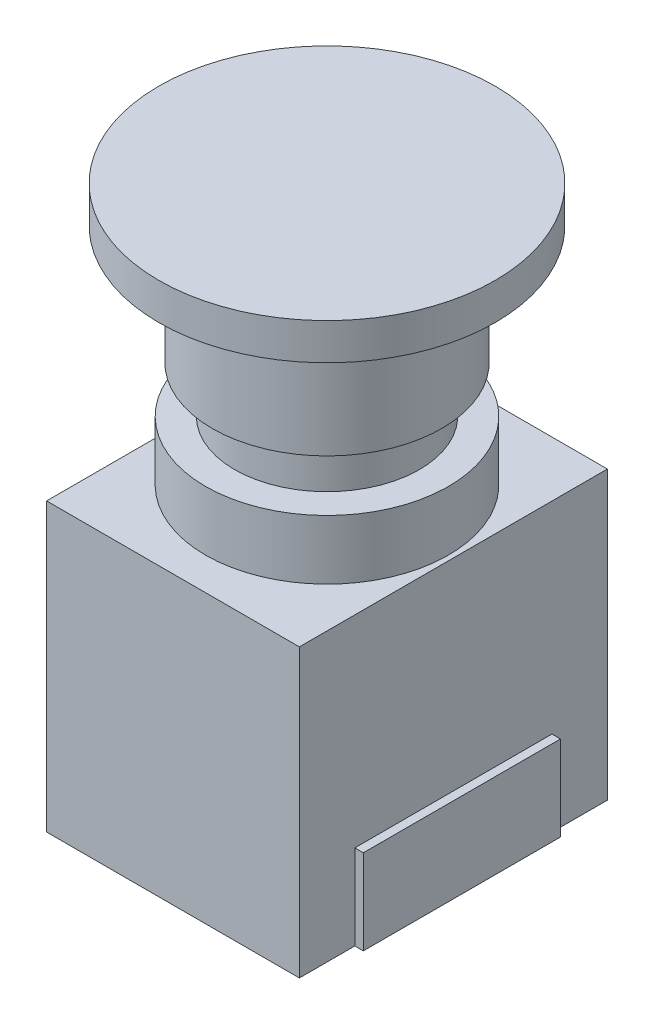
ISO-10303-21;
HEADER;
FILE_DESCRIPTION(('STEP AP214'),'2;1');
FILE_NAME('part.step','',(''),(''),'','','');
FILE_SCHEMA(('AUTOMOTIVE_DESIGN { 1 0 10303 214 1 1 1 1 }'));
ENDSEC;
DATA;
#1=APPLICATION_CONTEXT('core data for automotive mechanical design processes');
#2=APPLICATION_PROTOCOL_DEFINITION('international standard','automotive_design',2000,#1);
#3=PRODUCT_CONTEXT('',#1,'mechanical');
#4=PRODUCT('Part','Part','',(#3));
#5=PRODUCT_RELATED_PRODUCT_CATEGORY('part','',(#4));
#6=PRODUCT_DEFINITION_FORMATION('','',#4);
#7=PRODUCT_DEFINITION_CONTEXT('part definition',#1,'design');
#8=PRODUCT_DEFINITION('design','',#6,#7);
#9=PRODUCT_DEFINITION_SHAPE('','',#8);
#10=(LENGTH_UNIT() NAMED_UNIT(*) SI_UNIT(.MILLI.,.METRE.));
#11=(NAMED_UNIT(*) PLANE_ANGLE_UNIT() SI_UNIT($,.RADIAN.));
#12=(NAMED_UNIT(*) SI_UNIT($,.STERADIAN.) SOLID_ANGLE_UNIT());
#13=UNCERTAINTY_MEASURE_WITH_UNIT(LENGTH_MEASURE(1.E-05),#10,'distance_accuracy_value','');
#14=(GEOMETRIC_REPRESENTATION_CONTEXT(3) GLOBAL_UNCERTAINTY_ASSIGNED_CONTEXT((#13)) GLOBAL_UNIT_ASSIGNED_CONTEXT((#10,
#11,#12)) REPRESENTATION_CONTEXT('',''));
#15=CARTESIAN_POINT('',(0.,0.,0.));
#16=DIRECTION('',(0.,0.,1.));
#17=DIRECTION('',(1.,0.,0.));
#18=AXIS2_PLACEMENT_3D('',#15,#16,#17);
#19=CARTESIAN_POINT('',(14.875,33.75,18.125));
#20=DIRECTION('',(-1.,0.,0.));
#21=DIRECTION('',(0.,0.,1.));
#22=AXIS2_PLACEMENT_3D('',#19,#20,#21);
#23=PLANE('',#22);
#24=DIRECTION('',(0.,-1.,0.));
#25=VECTOR('',#24,1.);
#26=CARTESIAN_POINT('',(14.875,0.,11.6));
#27=LINE('',#26,#25);
#28=CARTESIAN_POINT('',(14.875,10.,11.6));
#29=VERTEX_POINT('',#28);
#30=CARTESIAN_POINT('',(14.875,0.,11.6));
#31=VERTEX_POINT('',#30);
#32=EDGE_CURVE('E68',#29,#31,#27,.T.);
#33=ORIENTED_EDGE('',*,*,#32,.F.);
#34=DIRECTION('',(0.,0.,1.));
#35=VECTOR('',#34,1.);
#36=CARTESIAN_POINT('',(14.875,10.,11.6));
#37=LINE('',#36,#35);
#38=CARTESIAN_POINT('',(14.875,10.,-11.6));
#39=VERTEX_POINT('',#38);
#40=EDGE_CURVE('E138',#39,#29,#37,.T.);
#41=ORIENTED_EDGE('',*,*,#40,.F.);
#42=DIRECTION('',(0.,1.,0.));
#43=VECTOR('',#42,1.);
#44=CARTESIAN_POINT('',(14.875,0.,-11.6));
#45=LINE('',#44,#43);
#46=CARTESIAN_POINT('',(14.875,0.,-11.6));
#47=VERTEX_POINT('',#46);
#48=EDGE_CURVE('E74',#47,#39,#45,.T.);
#49=ORIENTED_EDGE('',*,*,#48,.F.);
#50=DIRECTION('',(0.,0.,-1.));
#51=VECTOR('',#50,1.);
#52=CARTESIAN_POINT('',(14.875,0.,18.125));
#53=LINE('',#52,#51);
#54=CARTESIAN_POINT('',(14.875,0.,-18.125));
#55=VERTEX_POINT('',#54);
#56=EDGE_CURVE('E182',#47,#55,#53,.T.);
#57=ORIENTED_EDGE('',*,*,#56,.T.);
#58=DIRECTION('',(0.,-1.,0.));
#59=VECTOR('',#58,1.);
#60=CARTESIAN_POINT('',(14.875,33.75,-18.125));
#61=LINE('',#60,#59);
#62=CARTESIAN_POINT('',(14.875,33.75,-18.125));
#63=VERTEX_POINT('',#62);
#64=EDGE_CURVE('E188',#63,#55,#61,.T.);
#65=ORIENTED_EDGE('',*,*,#64,.F.);
#66=DIRECTION('',(0.,0.,-1.));
#67=VECTOR('',#66,1.);
#68=CARTESIAN_POINT('',(14.875,33.75,18.125));
#69=LINE('',#68,#67);
#70=CARTESIAN_POINT('',(14.875,33.75,18.125));
#71=VERTEX_POINT('',#70);
#72=EDGE_CURVE('E173',#71,#63,#69,.T.);
#73=ORIENTED_EDGE('',*,*,#72,.F.);
#74=DIRECTION('',(0.,-1.,0.));
#75=VECTOR('',#74,1.);
#76=CARTESIAN_POINT('',(14.875,33.75,18.125));
#77=LINE('',#76,#75);
#78=CARTESIAN_POINT('',(14.875,0.,18.125));
#79=VERTEX_POINT('',#78);
#80=EDGE_CURVE('E190',#71,#79,#77,.T.);
#81=ORIENTED_EDGE('',*,*,#80,.T.);
#82=EDGE_CURVE('E183',#79,#31,#53,.T.);
#83=ORIENTED_EDGE('',*,*,#82,.T.);
#84=EDGE_LOOP('',(#33,#41,#49,#57,#65,#73,#81,#83));
#85=FACE_BOUND('',#84,.T.);
#86=ADVANCED_FACE('F51',(#85),#23,.F.);
#87=CARTESIAN_POINT('',(-14.875,33.75,18.125));
#88=DIRECTION('',(1.,0.,0.));
#89=DIRECTION('',(0.,0.,-1.));
#90=AXIS2_PLACEMENT_3D('',#87,#88,#89);
#91=PLANE('',#90);
#92=DIRECTION('',(0.,0.,1.));
#93=VECTOR('',#92,1.);
#94=CARTESIAN_POINT('',(-14.875,0.,18.125));
#95=LINE('',#94,#93);
#96=CARTESIAN_POINT('',(-14.875,0.,-18.125));
#97=VERTEX_POINT('',#96);
#98=CARTESIAN_POINT('',(-14.875,0.,18.125));
#99=VERTEX_POINT('',#98);
#100=EDGE_CURVE('E164',#97,#99,#95,.T.);
#101=ORIENTED_EDGE('',*,*,#100,.T.);
#102=DIRECTION('',(0.,-1.,0.));
#103=VECTOR('',#102,1.);
#104=CARTESIAN_POINT('',(-14.875,33.75,18.125));
#105=LINE('',#104,#103);
#106=CARTESIAN_POINT('',(-14.875,33.75,18.125));
#107=VERTEX_POINT('',#106);
#108=EDGE_CURVE('E55',#107,#99,#105,.T.);
#109=ORIENTED_EDGE('',*,*,#108,.F.);
#110=DIRECTION('',(0.,0.,1.));
#111=VECTOR('',#110,1.);
#112=CARTESIAN_POINT('',(-14.875,33.75,18.125));
#113=LINE('',#112,#111);
#114=CARTESIAN_POINT('',(-14.875,33.75,-18.125));
#115=VERTEX_POINT('',#114);
#116=EDGE_CURVE('E167',#115,#107,#113,.T.);
#117=ORIENTED_EDGE('',*,*,#116,.F.);
#118=DIRECTION('',(0.,-1.,0.));
#119=VECTOR('',#118,1.);
#120=CARTESIAN_POINT('',(-14.875,33.75,-18.125));
#121=LINE('',#120,#119);
#122=EDGE_CURVE('E177',#115,#97,#121,.T.);
#123=ORIENTED_EDGE('',*,*,#122,.T.);
#124=EDGE_LOOP('',(#101,#109,#117,#123));
#125=FACE_BOUND('',#124,.T.);
#126=ADVANCED_FACE('F53',(#125),#91,.F.);
#127=CARTESIAN_POINT('',(14.875,33.75,18.125));
#128=DIRECTION('',(0.,0.,-1.));
#129=DIRECTION('',(-1.,0.,0.));
#130=AXIS2_PLACEMENT_3D('',#127,#128,#129);
#131=PLANE('',#130);
#132=DIRECTION('',(1.,0.,0.));
#133=VECTOR('',#132,1.);
#134=CARTESIAN_POINT('',(14.875,0.,18.125));
#135=LINE('',#134,#133);
#136=EDGE_CURVE('E180',#99,#79,#135,.T.);
#137=ORIENTED_EDGE('',*,*,#136,.T.);
#138=ORIENTED_EDGE('',*,*,#80,.F.);
#139=DIRECTION('',(1.,0.,0.));
#140=VECTOR('',#139,1.);
#141=CARTESIAN_POINT('',(14.875,33.75,18.125));
#142=LINE('',#141,#140);
#143=EDGE_CURVE('E170',#107,#71,#142,.T.);
#144=ORIENTED_EDGE('',*,*,#143,.F.);
#145=ORIENTED_EDGE('',*,*,#108,.T.);
#146=EDGE_LOOP('',(#137,#138,#144,#145));
#147=FACE_BOUND('',#146,.T.);
#148=ADVANCED_FACE('F197',(#147),#131,.F.);
#149=CARTESIAN_POINT('',(14.875,33.75,-18.125));
#150=DIRECTION('',(0.,0.,1.));
#151=DIRECTION('',(1.,0.,0.));
#152=AXIS2_PLACEMENT_3D('',#149,#150,#151);
#153=PLANE('',#152);
#154=DIRECTION('',(-1.,0.,0.));
#155=VECTOR('',#154,1.);
#156=CARTESIAN_POINT('',(14.875,0.,-18.125));
#157=LINE('',#156,#155);
#158=EDGE_CURVE('E171',#55,#97,#157,.T.);
#159=ORIENTED_EDGE('',*,*,#158,.T.);
#160=ORIENTED_EDGE('',*,*,#122,.F.);
#161=DIRECTION('',(-1.,0.,0.));
#162=VECTOR('',#161,1.);
#163=CARTESIAN_POINT('',(14.875,33.75,-18.125));
#164=LINE('',#163,#162);
#165=EDGE_CURVE('E175',#63,#115,#164,.T.);
#166=ORIENTED_EDGE('',*,*,#165,.F.);
#167=ORIENTED_EDGE('',*,*,#64,.T.);
#168=EDGE_LOOP('',(#159,#160,#166,#167));
#169=FACE_BOUND('',#168,.T.);
#170=ADVANCED_FACE('F210',(#169),#153,.F.);
#171=CARTESIAN_POINT('',(0.,33.75,0.));
#172=DIRECTION('',(0.,1.,0.));
#173=DIRECTION('',(0.,0.,1.));
#174=AXIS2_PLACEMENT_3D('',#171,#172,#173);
#175=PLANE('',#174);
#176=CARTESIAN_POINT('',(0.,33.75,0.));
#177=DIRECTION('',(0.,1.,0.));
#178=DIRECTION('',(0.,0.,1.));
#179=AXIS2_PLACEMENT_3D('',#176,#177,#178);
#180=CIRCLE('',#179,14.3);
#181=CARTESIAN_POINT('',(0.,33.75,14.3));
#182=VERTEX_POINT('',#181);
#183=EDGE_CURVE('E60',#182,#182,#180,.T.);
#184=ORIENTED_EDGE('',*,*,#183,.F.);
#185=EDGE_LOOP('',(#184));
#186=FACE_BOUND('',#185,.T.);
#187=ORIENTED_EDGE('',*,*,#116,.T.);
#188=ORIENTED_EDGE('',*,*,#143,.T.);
#189=ORIENTED_EDGE('',*,*,#72,.T.);
#190=ORIENTED_EDGE('',*,*,#165,.T.);
#191=EDGE_LOOP('',(#187,#188,#189,#190));
#192=FACE_BOUND('',#191,.T.);
#193=ADVANCED_FACE('F216',(#186,#192),#175,.T.);
#194=CARTESIAN_POINT('',(0.,0.,0.));
#195=DIRECTION('',(0.,1.,0.));
#196=DIRECTION('',(0.,0.,1.));
#197=AXIS2_PLACEMENT_3D('',#194,#195,#196);
#198=PLANE('',#197);
#199=ORIENTED_EDGE('',*,*,#100,.F.);
#200=ORIENTED_EDGE('',*,*,#158,.F.);
#201=ORIENTED_EDGE('',*,*,#56,.F.);
#202=DIRECTION('',(-1.,0.,0.));
#203=VECTOR('',#202,1.);
#204=CARTESIAN_POINT('',(15.875,0.,-11.6));
#205=LINE('',#204,#203);
#206=CARTESIAN_POINT('',(15.875,0.,-11.6));
#207=VERTEX_POINT('',#206);
#208=EDGE_CURVE('E125',#207,#47,#205,.T.);
#209=ORIENTED_EDGE('',*,*,#208,.F.);
#210=DIRECTION('',(0.,0.,-1.));
#211=VECTOR('',#210,1.);
#212=CARTESIAN_POINT('',(15.875,0.,11.6));
#213=LINE('',#212,#211);
#214=CARTESIAN_POINT('',(15.875,0.,11.6));
#215=VERTEX_POINT('',#214);
#216=EDGE_CURVE('E117',#215,#207,#213,.T.);
#217=ORIENTED_EDGE('',*,*,#216,.F.);
#218=DIRECTION('',(-1.,0.,0.));
#219=VECTOR('',#218,1.);
#220=CARTESIAN_POINT('',(15.875,0.,11.6));
#221=LINE('',#220,#219);
#222=EDGE_CURVE('E123',#215,#31,#221,.T.);
#223=ORIENTED_EDGE('',*,*,#222,.T.);
#224=ORIENTED_EDGE('',*,*,#82,.F.);
#225=ORIENTED_EDGE('',*,*,#136,.F.);
#226=EDGE_LOOP('',(#199,#200,#201,#209,#217,#223,#224,#225));
#227=FACE_BOUND('',#226,.T.);
#228=ADVANCED_FACE('F120',(#227),#198,.F.);
#229=CARTESIAN_POINT('',(0.,40.75,0.));
#230=DIRECTION('',(0.,-1.,0.));
#231=DIRECTION('',(0.,0.,-1.));
#232=AXIS2_PLACEMENT_3D('',#229,#230,#231);
#233=CYLINDRICAL_SURFACE('',#232,14.3);
#234=CARTESIAN_POINT('',(0.,40.75,0.));
#235=DIRECTION('',(0.,1.,0.));
#236=DIRECTION('',(0.,0.,1.));
#237=AXIS2_PLACEMENT_3D('',#234,#235,#236);
#238=CIRCLE('',#237,14.3);
#239=CARTESIAN_POINT('',(0.,40.75,14.3));
#240=VERTEX_POINT('',#239);
#241=EDGE_CURVE('E160',#240,#240,#238,.T.);
#242=ORIENTED_EDGE('',*,*,#241,.F.);
#243=EDGE_LOOP('',(#242));
#244=FACE_BOUND('',#243,.T.);
#245=ORIENTED_EDGE('',*,*,#183,.T.);
#246=EDGE_LOOP('',(#245));
#247=FACE_BOUND('',#246,.T.);
#248=ADVANCED_FACE('F276',(#244,#247),#233,.T.);
#249=CARTESIAN_POINT('',(0.,40.75,0.));
#250=DIRECTION('',(0.,1.,0.));
#251=DIRECTION('',(0.,0.,1.));
#252=AXIS2_PLACEMENT_3D('',#249,#250,#251);
#253=PLANE('',#252);
#254=CARTESIAN_POINT('',(0.,40.75,0.));
#255=DIRECTION('',(0.,1.,0.));
#256=DIRECTION('',(0.,0.,1.));
#257=AXIS2_PLACEMENT_3D('',#254,#255,#256);
#258=CIRCLE('',#257,10.875);
#259=CARTESIAN_POINT('',(0.,40.75,10.875));
#260=VERTEX_POINT('',#259);
#261=EDGE_CURVE('E11',#260,#260,#258,.T.);
#262=ORIENTED_EDGE('',*,*,#261,.F.);
#263=EDGE_LOOP('',(#262));
#264=FACE_BOUND('',#263,.T.);
#265=ORIENTED_EDGE('',*,*,#241,.T.);
#266=EDGE_LOOP('',(#265));
#267=FACE_BOUND('',#266,.T.);
#268=ADVANCED_FACE('F272',(#264,#267),#253,.T.);
#269=CARTESIAN_POINT('',(0.,46.25,0.));
#270=DIRECTION('',(0.,-1.,0.));
#271=DIRECTION('',(0.,0.,-1.));
#272=AXIS2_PLACEMENT_3D('',#269,#270,#271);
#273=CYLINDRICAL_SURFACE('',#272,10.875);
#274=CARTESIAN_POINT('',(0.,46.25,0.));
#275=DIRECTION('',(0.,1.,0.));
#276=DIRECTION('',(0.,0.,1.));
#277=AXIS2_PLACEMENT_3D('',#274,#275,#276);
#278=CIRCLE('',#277,10.875);
#279=CARTESIAN_POINT('',(0.,46.25,10.875));
#280=VERTEX_POINT('',#279);
#281=EDGE_CURVE('E156',#280,#280,#278,.T.);
#282=ORIENTED_EDGE('',*,*,#281,.F.);
#283=EDGE_LOOP('',(#282));
#284=FACE_BOUND('',#283,.T.);
#285=ORIENTED_EDGE('',*,*,#261,.T.);
#286=EDGE_LOOP('',(#285));
#287=FACE_BOUND('',#286,.T.);
#288=ADVANCED_FACE('F268',(#284,#287),#273,.T.);
#289=CARTESIAN_POINT('',(0.,60.2,0.));
#290=DIRECTION('',(0.,-1.,0.));
#291=DIRECTION('',(0.,0.,-1.));
#292=AXIS2_PLACEMENT_3D('',#289,#290,#291);
#293=CYLINDRICAL_SURFACE('',#292,13.5);
#294=CARTESIAN_POINT('',(0.,60.2,0.));
#295=DIRECTION('',(0.,1.,0.));
#296=DIRECTION('',(0.,0.,1.));
#297=AXIS2_PLACEMENT_3D('',#294,#295,#296);
#298=CIRCLE('',#297,13.5);
#299=CARTESIAN_POINT('',(0.,60.2,13.5));
#300=VERTEX_POINT('',#299);
#301=EDGE_CURVE('E153',#300,#300,#298,.T.);
#302=ORIENTED_EDGE('',*,*,#301,.F.);
#303=EDGE_LOOP('',(#302));
#304=FACE_BOUND('',#303,.T.);
#305=CARTESIAN_POINT('',(0.,46.25,0.));
#306=DIRECTION('',(0.,1.,0.));
#307=DIRECTION('',(0.,0.,1.));
#308=AXIS2_PLACEMENT_3D('',#305,#306,#307);
#309=CIRCLE('',#308,13.5);
#310=CARTESIAN_POINT('',(0.,46.25,13.5));
#311=VERTEX_POINT('',#310);
#312=EDGE_CURVE('E151',#311,#311,#309,.T.);
#313=ORIENTED_EDGE('',*,*,#312,.T.);
#314=EDGE_LOOP('',(#313));
#315=FACE_BOUND('',#314,.T.);
#316=ADVANCED_FACE('F264',(#304,#315),#293,.T.);
#317=CARTESIAN_POINT('',(0.,46.25,0.));
#318=DIRECTION('',(0.,1.,0.));
#319=DIRECTION('',(0.,0.,1.));
#320=AXIS2_PLACEMENT_3D('',#317,#318,#319);
#321=PLANE('',#320);
#322=ORIENTED_EDGE('',*,*,#281,.T.);
#323=EDGE_LOOP('',(#322));
#324=FACE_BOUND('',#323,.T.);
#325=ORIENTED_EDGE('',*,*,#312,.F.);
#326=EDGE_LOOP('',(#325));
#327=FACE_BOUND('',#326,.T.);
#328=ADVANCED_FACE('F260',(#324,#327),#321,.F.);
#329=CARTESIAN_POINT('',(0.,64.5,0.));
#330=DIRECTION('',(0.,-1.,0.));
#331=DIRECTION('',(0.,0.,-1.));
#332=AXIS2_PLACEMENT_3D('',#329,#330,#331);
#333=CYLINDRICAL_SURFACE('',#332,19.8);
#334=CARTESIAN_POINT('',(0.,64.5,0.));
#335=DIRECTION('',(0.,1.,0.));
#336=DIRECTION('',(0.,0.,1.));
#337=AXIS2_PLACEMENT_3D('',#334,#335,#336);
#338=CIRCLE('',#337,19.8);
#339=CARTESIAN_POINT('',(0.,64.5,19.8));
#340=VERTEX_POINT('',#339);
#341=EDGE_CURVE('E144',#340,#340,#338,.T.);
#342=ORIENTED_EDGE('',*,*,#341,.F.);
#343=EDGE_LOOP('',(#342));
#344=FACE_BOUND('',#343,.T.);
#345=CARTESIAN_POINT('',(0.,60.2,0.));
#346=DIRECTION('',(0.,1.,0.));
#347=DIRECTION('',(0.,0.,1.));
#348=AXIS2_PLACEMENT_3D('',#345,#346,#347);
#349=CIRCLE('',#348,19.8);
#350=CARTESIAN_POINT('',(0.,60.2,19.8));
#351=VERTEX_POINT('',#350);
#352=EDGE_CURVE('E141',#351,#351,#349,.T.);
#353=ORIENTED_EDGE('',*,*,#352,.T.);
#354=EDGE_LOOP('',(#353));
#355=FACE_BOUND('',#354,.T.);
#356=ADVANCED_FACE('F253',(#344,#355),#333,.T.);
#357=CARTESIAN_POINT('',(0.,64.5,0.));
#358=DIRECTION('',(0.,1.,0.));
#359=DIRECTION('',(0.,0.,1.));
#360=AXIS2_PLACEMENT_3D('',#357,#358,#359);
#361=PLANE('',#360);
#362=ORIENTED_EDGE('',*,*,#341,.T.);
#363=EDGE_LOOP('',(#362));
#364=FACE_BOUND('',#363,.T.);
#365=ADVANCED_FACE('F250',(#364),#361,.T.);
#366=CARTESIAN_POINT('',(0.,60.2,0.));
#367=DIRECTION('',(0.,1.,0.));
#368=DIRECTION('',(0.,0.,1.));
#369=AXIS2_PLACEMENT_3D('',#366,#367,#368);
#370=PLANE('',#369);
#371=ORIENTED_EDGE('',*,*,#301,.T.);
#372=EDGE_LOOP('',(#371));
#373=FACE_BOUND('',#372,.T.);
#374=ORIENTED_EDGE('',*,*,#352,.F.);
#375=EDGE_LOOP('',(#374));
#376=FACE_BOUND('',#375,.T.);
#377=ADVANCED_FACE('F249',(#373,#376),#370,.F.);
#378=CARTESIAN_POINT('',(15.875,0.,11.6));
#379=DIRECTION('',(0.,0.,-1.));
#380=DIRECTION('',(0.,1.,0.));
#381=AXIS2_PLACEMENT_3D('',#378,#379,#380);
#382=PLANE('',#381);
#383=ORIENTED_EDGE('',*,*,#32,.T.);
#384=ORIENTED_EDGE('',*,*,#222,.F.);
#385=DIRECTION('',(0.,-1.,0.));
#386=VECTOR('',#385,1.);
#387=CARTESIAN_POINT('',(15.875,0.,11.6));
#388=LINE('',#387,#386);
#389=CARTESIAN_POINT('',(15.875,10.,11.6));
#390=VERTEX_POINT('',#389);
#391=EDGE_CURVE('E129',#390,#215,#388,.T.);
#392=ORIENTED_EDGE('',*,*,#391,.F.);
#393=DIRECTION('',(-1.,0.,0.));
#394=VECTOR('',#393,1.);
#395=CARTESIAN_POINT('',(15.875,10.,11.6));
#396=LINE('',#395,#394);
#397=EDGE_CURVE('E230',#390,#29,#396,.T.);
#398=ORIENTED_EDGE('',*,*,#397,.T.);
#399=EDGE_LOOP('',(#383,#384,#392,#398));
#400=FACE_BOUND('',#399,.T.);
#401=ADVANCED_FACE('F140',(#400),#382,.F.);
#402=CARTESIAN_POINT('',(15.875,0.,-11.6));
#403=DIRECTION('',(0.,0.,1.));
#404=DIRECTION('',(1.,0.,0.));
#405=AXIS2_PLACEMENT_3D('',#402,#403,#404);
#406=PLANE('',#405);
#407=ORIENTED_EDGE('',*,*,#48,.T.);
#408=DIRECTION('',(-1.,0.,0.));
#409=VECTOR('',#408,1.);
#410=CARTESIAN_POINT('',(15.875,10.,-11.6));
#411=LINE('',#410,#409);
#412=CARTESIAN_POINT('',(15.875,10.,-11.6));
#413=VERTEX_POINT('',#412);
#414=EDGE_CURVE('E146',#413,#39,#411,.T.);
#415=ORIENTED_EDGE('',*,*,#414,.F.);
#416=DIRECTION('',(0.,1.,0.));
#417=VECTOR('',#416,1.);
#418=CARTESIAN_POINT('',(15.875,0.,-11.6));
#419=LINE('',#418,#417);
#420=EDGE_CURVE('E128',#207,#413,#419,.T.);
#421=ORIENTED_EDGE('',*,*,#420,.F.);
#422=ORIENTED_EDGE('',*,*,#208,.T.);
#423=EDGE_LOOP('',(#407,#415,#421,#422));
#424=FACE_BOUND('',#423,.T.);
#425=ADVANCED_FACE('F226',(#424),#406,.F.);
#426=CARTESIAN_POINT('',(15.875,10.,11.6));
#427=DIRECTION('',(0.,-1.,0.));
#428=DIRECTION('',(0.,0.,-1.));
#429=AXIS2_PLACEMENT_3D('',#426,#427,#428);
#430=PLANE('',#429);
#431=ORIENTED_EDGE('',*,*,#40,.T.);
#432=ORIENTED_EDGE('',*,*,#397,.F.);
#433=DIRECTION('',(0.,0.,1.));
#434=VECTOR('',#433,1.);
#435=CARTESIAN_POINT('',(15.875,10.,11.6));
#436=LINE('',#435,#434);
#437=EDGE_CURVE('E134',#413,#390,#436,.T.);
#438=ORIENTED_EDGE('',*,*,#437,.F.);
#439=ORIENTED_EDGE('',*,*,#414,.T.);
#440=EDGE_LOOP('',(#431,#432,#438,#439));
#441=FACE_BOUND('',#440,.T.);
#442=ADVANCED_FACE('F237',(#441),#430,.F.);
#443=CARTESIAN_POINT('',(15.875,0.,0.));
#444=DIRECTION('',(-1.,0.,0.));
#445=DIRECTION('',(0.,0.,1.));
#446=AXIS2_PLACEMENT_3D('',#443,#444,#445);
#447=PLANE('',#446);
#448=ORIENTED_EDGE('',*,*,#391,.T.);
#449=ORIENTED_EDGE('',*,*,#216,.T.);
#450=ORIENTED_EDGE('',*,*,#420,.T.);
#451=ORIENTED_EDGE('',*,*,#437,.T.);
#452=EDGE_LOOP('',(#448,#449,#450,#451));
#453=FACE_BOUND('',#452,.T.);
#454=ADVANCED_FACE('F132',(#453),#447,.F.);
#455=CLOSED_SHELL('',(#86,#126,#148,#170,#193,#228,#248,#268,#288,#316,#328,#356,#365,#377,#401,
#425,#442,#454));
#456=MANIFOLD_SOLID_BREP('B2',#455);
#457=ADVANCED_BREP_SHAPE_REPRESENTATION('',(#18,#456),#14);
#458=SHAPE_DEFINITION_REPRESENTATION(#9,#457);
ENDSEC;
END-ISO-10303-21;
